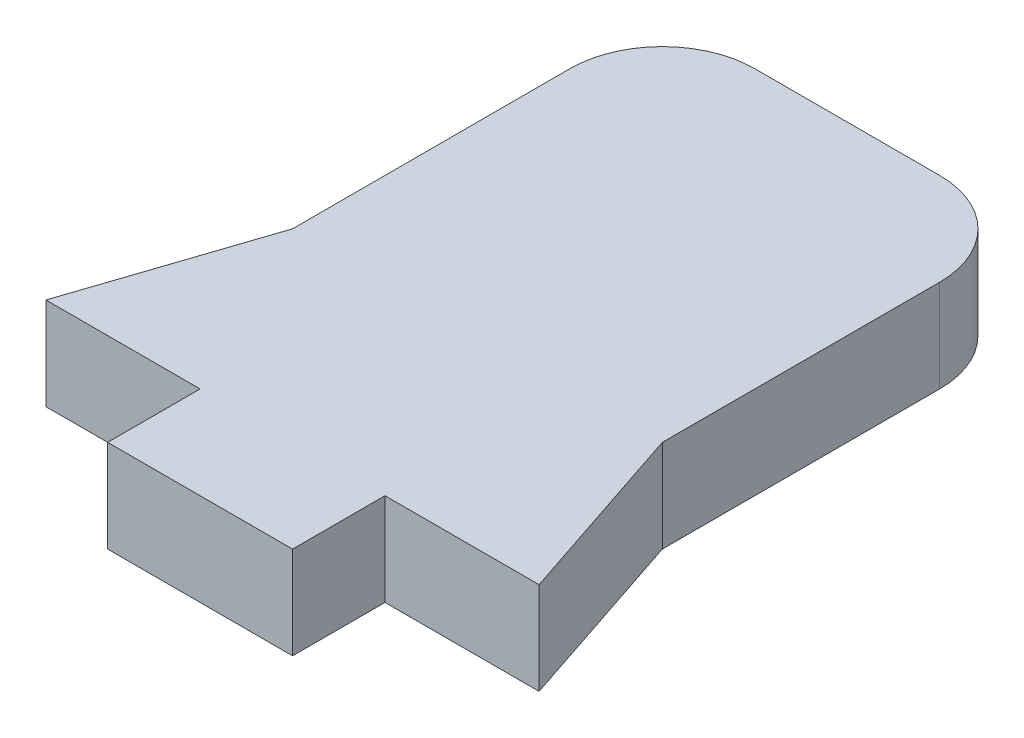
ISO-10303-21;
HEADER;
FILE_DESCRIPTION(('STEP AP214'),'2;1');
FILE_NAME('part.step','',(''),(''),'','','');
FILE_SCHEMA(('AUTOMOTIVE_DESIGN { 1 0 10303 214 1 1 1 1 }'));
ENDSEC;
DATA;
#1=APPLICATION_CONTEXT('core data for automotive mechanical design processes');
#2=APPLICATION_PROTOCOL_DEFINITION('international standard','automotive_design',2000,#1);
#3=PRODUCT_CONTEXT('',#1,'mechanical');
#4=PRODUCT('Part','Part','',(#3));
#5=PRODUCT_RELATED_PRODUCT_CATEGORY('part','',(#4));
#6=PRODUCT_DEFINITION_FORMATION('','',#4);
#7=PRODUCT_DEFINITION_CONTEXT('part definition',#1,'design');
#8=PRODUCT_DEFINITION('design','',#6,#7);
#9=PRODUCT_DEFINITION_SHAPE('','',#8);
#10=(LENGTH_UNIT() NAMED_UNIT(*) SI_UNIT(.MILLI.,.METRE.));
#11=(NAMED_UNIT(*) PLANE_ANGLE_UNIT() SI_UNIT($,.RADIAN.));
#12=(NAMED_UNIT(*) SI_UNIT($,.STERADIAN.) SOLID_ANGLE_UNIT());
#13=UNCERTAINTY_MEASURE_WITH_UNIT(LENGTH_MEASURE(1.E-05),#10,'distance_accuracy_value','');
#14=(GEOMETRIC_REPRESENTATION_CONTEXT(3) GLOBAL_UNCERTAINTY_ASSIGNED_CONTEXT((#13)) GLOBAL_UNIT_ASSIGNED_CONTEXT((#10,
#11,#12)) REPRESENTATION_CONTEXT('',''));
#15=CARTESIAN_POINT('',(0.,0.,0.));
#16=DIRECTION('',(0.,0.,1.));
#17=DIRECTION('',(1.,0.,0.));
#18=AXIS2_PLACEMENT_3D('',#15,#16,#17);
#19=CARTESIAN_POINT('',(6.,1.5,-7.5));
#20=DIRECTION('',(-1.,0.,0.));
#21=DIRECTION('',(0.,0.,1.));
#22=AXIS2_PLACEMENT_3D('',#19,#20,#21);
#23=PLANE('',#22);
#24=DIRECTION('',(0.,-1.,0.));
#25=VECTOR('',#24,1.);
#26=CARTESIAN_POINT('',(6.,1.5,1.5));
#27=LINE('',#26,#25);
#28=CARTESIAN_POINT('',(6.,1.5,1.5));
#29=VERTEX_POINT('',#28);
#30=CARTESIAN_POINT('',(6.,-1.5,1.5));
#31=VERTEX_POINT('',#30);
#32=EDGE_CURVE('E147',#29,#31,#27,.T.);
#33=ORIENTED_EDGE('',*,*,#32,.T.);
#34=DIRECTION('',(0.,0.,-1.));
#35=VECTOR('',#34,1.);
#36=CARTESIAN_POINT('',(6.,-1.5,-7.5));
#37=LINE('',#36,#35);
#38=CARTESIAN_POINT('',(6.,-1.5,-7.5));
#39=VERTEX_POINT('',#38);
#40=EDGE_CURVE('E188',#31,#39,#37,.T.);
#41=ORIENTED_EDGE('',*,*,#40,.T.);
#42=DIRECTION('',(0.,-1.,0.));
#43=VECTOR('',#42,1.);
#44=CARTESIAN_POINT('',(6.,1.5,-7.5));
#45=LINE('',#44,#43);
#46=CARTESIAN_POINT('',(6.,1.5,-7.5));
#47=VERTEX_POINT('',#46);
#48=EDGE_CURVE('E11',#47,#39,#45,.T.);
#49=ORIENTED_EDGE('',*,*,#48,.F.);
#50=DIRECTION('',(0.,0.,-1.));
#51=VECTOR('',#50,1.);
#52=CARTESIAN_POINT('',(6.,1.5,-7.5));
#53=LINE('',#52,#51);
#54=EDGE_CURVE('E50',#29,#47,#53,.T.);
#55=ORIENTED_EDGE('',*,*,#54,.F.);
#56=EDGE_LOOP('',(#33,#41,#49,#55));
#57=FACE_BOUND('',#56,.T.);
#58=ADVANCED_FACE('F36',(#57),#23,.F.);
#59=CARTESIAN_POINT('',(-6.,1.5,-7.5));
#60=DIRECTION('',(1.,0.,0.));
#61=DIRECTION('',(0.,0.,-1.));
#62=AXIS2_PLACEMENT_3D('',#59,#60,#61);
#63=PLANE('',#62);
#64=DIRECTION('',(0.,-1.,0.));
#65=VECTOR('',#64,1.);
#66=CARTESIAN_POINT('',(-6.,1.5,1.5));
#67=LINE('',#66,#65);
#68=CARTESIAN_POINT('',(-6.,1.5,1.5));
#69=VERTEX_POINT('',#68);
#70=CARTESIAN_POINT('',(-6.,-1.5,1.5));
#71=VERTEX_POINT('',#70);
#72=EDGE_CURVE('E58',#69,#71,#67,.T.);
#73=ORIENTED_EDGE('',*,*,#72,.F.);
#74=DIRECTION('',(0.,0.,1.));
#75=VECTOR('',#74,1.);
#76=CARTESIAN_POINT('',(-6.,1.5,-7.5));
#77=LINE('',#76,#75);
#78=CARTESIAN_POINT('',(-6.,1.5,-7.5));
#79=VERTEX_POINT('',#78);
#80=EDGE_CURVE('E137',#79,#69,#77,.T.);
#81=ORIENTED_EDGE('',*,*,#80,.F.);
#82=DIRECTION('',(0.,-1.,0.));
#83=VECTOR('',#82,1.);
#84=CARTESIAN_POINT('',(-6.,1.5,-7.5));
#85=LINE('',#84,#83);
#86=CARTESIAN_POINT('',(-6.,-1.5,-7.5));
#87=VERTEX_POINT('',#86);
#88=EDGE_CURVE('E199',#79,#87,#85,.T.);
#89=ORIENTED_EDGE('',*,*,#88,.T.);
#90=DIRECTION('',(0.,0.,1.));
#91=VECTOR('',#90,1.);
#92=CARTESIAN_POINT('',(-6.,-1.5,-7.5));
#93=LINE('',#92,#91);
#94=EDGE_CURVE('E207',#87,#71,#93,.T.);
#95=ORIENTED_EDGE('',*,*,#94,.T.);
#96=EDGE_LOOP('',(#73,#81,#89,#95));
#97=FACE_BOUND('',#96,.T.);
#98=ADVANCED_FACE('F234',(#97),#63,.F.);
#99=CARTESIAN_POINT('',(-6.,1.5,7.5));
#100=DIRECTION('',(0.,0.,-1.));
#101=DIRECTION('',(-1.,0.,0.));
#102=AXIS2_PLACEMENT_3D('',#99,#100,#101);
#103=PLANE('',#102);
#104=DIRECTION('',(0.,-1.,0.));
#105=VECTOR('',#104,1.);
#106=CARTESIAN_POINT('',(-3.00000000000001,1.5,7.5));
#107=LINE('',#106,#105);
#108=CARTESIAN_POINT('',(-3.00000000000001,1.5,7.5));
#109=VERTEX_POINT('',#108);
#110=CARTESIAN_POINT('',(-3.00000000000001,-1.5,7.5));
#111=VERTEX_POINT('',#110);
#112=EDGE_CURVE('E173',#109,#111,#107,.T.);
#113=ORIENTED_EDGE('',*,*,#112,.F.);
#114=DIRECTION('',(1.,0.,0.));
#115=VECTOR('',#114,1.);
#116=CARTESIAN_POINT('',(-6.,1.5,7.5));
#117=LINE('',#116,#115);
#118=CARTESIAN_POINT('',(-8.,1.5,7.5));
#119=VERTEX_POINT('',#118);
#120=EDGE_CURVE('E136',#119,#109,#117,.T.);
#121=ORIENTED_EDGE('',*,*,#120,.F.);
#122=DIRECTION('',(0.,-1.,0.));
#123=VECTOR('',#122,1.);
#124=CARTESIAN_POINT('',(-8.,1.5,7.5));
#125=LINE('',#124,#123);
#126=CARTESIAN_POINT('',(-8.,-1.5,7.5));
#127=VERTEX_POINT('',#126);
#128=EDGE_CURVE('E159',#119,#127,#125,.T.);
#129=ORIENTED_EDGE('',*,*,#128,.T.);
#130=DIRECTION('',(1.,0.,0.));
#131=VECTOR('',#130,1.);
#132=CARTESIAN_POINT('',(-6.,-1.5,7.5));
#133=LINE('',#132,#131);
#134=EDGE_CURVE('E191',#127,#111,#133,.T.);
#135=ORIENTED_EDGE('',*,*,#134,.T.);
#136=EDGE_LOOP('',(#113,#121,#129,#135));
#137=FACE_BOUND('',#136,.T.);
#138=ADVANCED_FACE('F241',(#137),#103,.F.);
#139=CARTESIAN_POINT('',(3.,1.5,-7.5));
#140=DIRECTION('',(0.,-1.,0.));
#141=DIRECTION('',(0.,0.,-1.));
#142=AXIS2_PLACEMENT_3D('',#139,#140,#141);
#143=CYLINDRICAL_SURFACE('',#142,3.);
#144=CARTESIAN_POINT('',(3.,-1.5,-7.5));
#145=DIRECTION('',(0.,1.,0.));
#146=DIRECTION('',(0.,0.,-1.));
#147=AXIS2_PLACEMENT_3D('',#144,#145,#146);
#148=CIRCLE('',#147,3.);
#149=CARTESIAN_POINT('',(3.,-1.5,-10.5));
#150=VERTEX_POINT('',#149);
#151=EDGE_CURVE('E201',#39,#150,#148,.T.);
#152=ORIENTED_EDGE('',*,*,#151,.T.);
#153=DIRECTION('',(0.,-1.,0.));
#154=VECTOR('',#153,1.);
#155=CARTESIAN_POINT('',(3.,1.5,-10.5));
#156=LINE('',#155,#154);
#157=CARTESIAN_POINT('',(3.,1.5,-10.5));
#158=VERTEX_POINT('',#157);
#159=EDGE_CURVE('E43',#158,#150,#156,.T.);
#160=ORIENTED_EDGE('',*,*,#159,.F.);
#161=CARTESIAN_POINT('',(3.,1.5,-7.5));
#162=DIRECTION('',(0.,1.,0.));
#163=DIRECTION('',(0.,0.,-1.));
#164=AXIS2_PLACEMENT_3D('',#161,#162,#163);
#165=CIRCLE('',#164,3.);
#166=EDGE_CURVE('E190',#47,#158,#165,.T.);
#167=ORIENTED_EDGE('',*,*,#166,.F.);
#168=ORIENTED_EDGE('',*,*,#48,.T.);
#169=EDGE_LOOP('',(#152,#160,#167,#168));
#170=FACE_BOUND('',#169,.T.);
#171=ADVANCED_FACE('F260',(#170),#143,.T.);
#172=CARTESIAN_POINT('',(-3.,1.5,-10.5));
#173=DIRECTION('',(0.,0.,1.));
#174=DIRECTION('',(1.,0.,0.));
#175=AXIS2_PLACEMENT_3D('',#172,#173,#174);
#176=PLANE('',#175);
#177=DIRECTION('',(-1.,0.,0.));
#178=VECTOR('',#177,1.);
#179=CARTESIAN_POINT('',(-3.,-1.5,-10.5));
#180=LINE('',#179,#178);
#181=CARTESIAN_POINT('',(-3.,-1.5,-10.5));
#182=VERTEX_POINT('',#181);
#183=EDGE_CURVE('E203',#150,#182,#180,.T.);
#184=ORIENTED_EDGE('',*,*,#183,.T.);
#185=DIRECTION('',(0.,-1.,0.));
#186=VECTOR('',#185,1.);
#187=CARTESIAN_POINT('',(-3.,1.5,-10.5));
#188=LINE('',#187,#186);
#189=CARTESIAN_POINT('',(-3.,1.5,-10.5));
#190=VERTEX_POINT('',#189);
#191=EDGE_CURVE('E213',#190,#182,#188,.T.);
#192=ORIENTED_EDGE('',*,*,#191,.F.);
#193=DIRECTION('',(-1.,0.,0.));
#194=VECTOR('',#193,1.);
#195=CARTESIAN_POINT('',(-3.,1.5,-10.5));
#196=LINE('',#195,#194);
#197=EDGE_CURVE('E193',#158,#190,#196,.T.);
#198=ORIENTED_EDGE('',*,*,#197,.F.);
#199=ORIENTED_EDGE('',*,*,#159,.T.);
#200=EDGE_LOOP('',(#184,#192,#198,#199));
#201=FACE_BOUND('',#200,.T.);
#202=ADVANCED_FACE('F220',(#201),#176,.F.);
#203=CARTESIAN_POINT('',(-3.,1.5,-7.5));
#204=DIRECTION('',(0.,-1.,0.));
#205=DIRECTION('',(0.,0.,-1.));
#206=AXIS2_PLACEMENT_3D('',#203,#204,#205);
#207=CYLINDRICAL_SURFACE('',#206,3.);
#208=CARTESIAN_POINT('',(-3.,-1.5,-7.5));
#209=DIRECTION('',(0.,1.,0.));
#210=DIRECTION('',(0.,0.,1.));
#211=AXIS2_PLACEMENT_3D('',#208,#209,#210);
#212=CIRCLE('',#211,3.);
#213=EDGE_CURVE('E205',#182,#87,#212,.T.);
#214=ORIENTED_EDGE('',*,*,#213,.T.);
#215=ORIENTED_EDGE('',*,*,#88,.F.);
#216=CARTESIAN_POINT('',(-3.,1.5,-7.5));
#217=DIRECTION('',(0.,1.,0.));
#218=DIRECTION('',(0.,0.,1.));
#219=AXIS2_PLACEMENT_3D('',#216,#217,#218);
#220=CIRCLE('',#219,3.);
#221=EDGE_CURVE('E195',#190,#79,#220,.T.);
#222=ORIENTED_EDGE('',*,*,#221,.F.);
#223=ORIENTED_EDGE('',*,*,#191,.T.);
#224=EDGE_LOOP('',(#214,#215,#222,#223));
#225=FACE_BOUND('',#224,.T.);
#226=ADVANCED_FACE('F232',(#225),#207,.T.);
#227=CARTESIAN_POINT('',(3.00000000000001,1.5,7.5));
#228=VERTEX_POINT('',#227);
#229=CARTESIAN_POINT('',(8.,1.5,7.5));
#230=VERTEX_POINT('',#229);
#231=EDGE_CURVE('E125',#228,#230,#117,.T.);
#232=ORIENTED_EDGE('',*,*,#231,.F.);
#233=DIRECTION('',(0.,-1.,0.));
#234=VECTOR('',#233,1.);
#235=CARTESIAN_POINT('',(3.00000000000001,1.5,7.5));
#236=LINE('',#235,#234);
#237=CARTESIAN_POINT('',(3.00000000000001,-1.5,7.5));
#238=VERTEX_POINT('',#237);
#239=EDGE_CURVE('E180',#228,#238,#236,.T.);
#240=ORIENTED_EDGE('',*,*,#239,.T.);
#241=CARTESIAN_POINT('',(8.,-1.5,7.5));
#242=VERTEX_POINT('',#241);
#243=EDGE_CURVE('E143',#238,#242,#133,.T.);
#244=ORIENTED_EDGE('',*,*,#243,.T.);
#245=DIRECTION('',(0.,-1.,0.));
#246=VECTOR('',#245,1.);
#247=CARTESIAN_POINT('',(8.,1.5,7.5));
#248=LINE('',#247,#246);
#249=EDGE_CURVE('E140',#230,#242,#248,.T.);
#250=ORIENTED_EDGE('',*,*,#249,.F.);
#251=EDGE_LOOP('',(#232,#240,#244,#250));
#252=FACE_BOUND('',#251,.T.);
#253=ADVANCED_FACE('F141',(#252),#103,.F.);
#254=CARTESIAN_POINT('',(-3.,1.5,-7.5));
#255=DIRECTION('',(0.,1.,0.));
#256=DIRECTION('',(0.,0.,1.));
#257=AXIS2_PLACEMENT_3D('',#254,#255,#256);
#258=PLANE('',#257);
#259=ORIENTED_EDGE('',*,*,#231,.T.);
#260=DIRECTION('',(-0.316227766016838,0.,-0.948683298050514));
#261=VECTOR('',#260,1.);
#262=CARTESIAN_POINT('',(6.,1.5,1.5));
#263=LINE('',#262,#261);
#264=EDGE_CURVE('E129',#230,#29,#263,.T.);
#265=ORIENTED_EDGE('',*,*,#264,.T.);
#266=ORIENTED_EDGE('',*,*,#54,.T.);
#267=ORIENTED_EDGE('',*,*,#166,.T.);
#268=ORIENTED_EDGE('',*,*,#197,.T.);
#269=ORIENTED_EDGE('',*,*,#221,.T.);
#270=ORIENTED_EDGE('',*,*,#80,.T.);
#271=DIRECTION('',(-0.316227766016838,0.,0.948683298050514));
#272=VECTOR('',#271,1.);
#273=CARTESIAN_POINT('',(-6.,1.5,1.5));
#274=LINE('',#273,#272);
#275=EDGE_CURVE('E156',#69,#119,#274,.T.);
#276=ORIENTED_EDGE('',*,*,#275,.T.);
#277=ORIENTED_EDGE('',*,*,#120,.T.);
#278=DIRECTION('',(0.,0.,1.));
#279=VECTOR('',#278,1.);
#280=CARTESIAN_POINT('',(-3.00000000000001,1.5,7.5));
#281=LINE('',#280,#279);
#282=CARTESIAN_POINT('',(-3.00000000000001,1.5,10.5));
#283=VERTEX_POINT('',#282);
#284=EDGE_CURVE('E166',#109,#283,#281,.T.);
#285=ORIENTED_EDGE('',*,*,#284,.T.);
#286=DIRECTION('',(1.,0.,0.));
#287=VECTOR('',#286,1.);
#288=CARTESIAN_POINT('',(-3.00000000000001,1.5,10.5));
#289=LINE('',#288,#287);
#290=CARTESIAN_POINT('',(2.99999999999999,1.5,10.5));
#291=VERTEX_POINT('',#290);
#292=EDGE_CURVE('E169',#283,#291,#289,.T.);
#293=ORIENTED_EDGE('',*,*,#292,.T.);
#294=DIRECTION('',(0.,0.,-1.));
#295=VECTOR('',#294,1.);
#296=CARTESIAN_POINT('',(3.00000000000001,1.5,7.5));
#297=LINE('',#296,#295);
#298=EDGE_CURVE('E132',#291,#228,#297,.T.);
#299=ORIENTED_EDGE('',*,*,#298,.T.);
#300=EDGE_LOOP('',(#259,#265,#266,#267,#268,#269,#270,#276,#277,#285,#293,#299));
#301=FACE_BOUND('',#300,.T.);
#302=ADVANCED_FACE('F127',(#301),#258,.T.);
#303=CARTESIAN_POINT('',(-3.,-1.5,-7.5));
#304=DIRECTION('',(0.,1.,0.));
#305=DIRECTION('',(0.,0.,1.));
#306=AXIS2_PLACEMENT_3D('',#303,#304,#305);
#307=PLANE('',#306);
#308=ORIENTED_EDGE('',*,*,#40,.F.);
#309=DIRECTION('',(-0.316227766016838,0.,-0.948683298050514));
#310=VECTOR('',#309,1.);
#311=CARTESIAN_POINT('',(6.,-1.5,1.5));
#312=LINE('',#311,#310);
#313=EDGE_CURVE('E150',#242,#31,#312,.T.);
#314=ORIENTED_EDGE('',*,*,#313,.F.);
#315=ORIENTED_EDGE('',*,*,#243,.F.);
#316=DIRECTION('',(0.,0.,-1.));
#317=VECTOR('',#316,1.);
#318=CARTESIAN_POINT('',(3.00000000000001,-1.5,7.5));
#319=LINE('',#318,#317);
#320=CARTESIAN_POINT('',(2.99999999999999,-1.5,10.5));
#321=VERTEX_POINT('',#320);
#322=EDGE_CURVE('E170',#321,#238,#319,.T.);
#323=ORIENTED_EDGE('',*,*,#322,.F.);
#324=DIRECTION('',(1.,0.,0.));
#325=VECTOR('',#324,1.);
#326=CARTESIAN_POINT('',(-3.00000000000001,-1.5,10.5));
#327=LINE('',#326,#325);
#328=CARTESIAN_POINT('',(-3.00000000000001,-1.5,10.5));
#329=VERTEX_POINT('',#328);
#330=EDGE_CURVE('E176',#329,#321,#327,.T.);
#331=ORIENTED_EDGE('',*,*,#330,.F.);
#332=DIRECTION('',(0.,0.,1.));
#333=VECTOR('',#332,1.);
#334=CARTESIAN_POINT('',(-3.00000000000001,-1.5,7.5));
#335=LINE('',#334,#333);
#336=EDGE_CURVE('E165',#111,#329,#335,.T.);
#337=ORIENTED_EDGE('',*,*,#336,.F.);
#338=ORIENTED_EDGE('',*,*,#134,.F.);
#339=DIRECTION('',(-0.316227766016838,0.,0.948683298050514));
#340=VECTOR('',#339,1.);
#341=CARTESIAN_POINT('',(-6.,-1.5,1.5));
#342=LINE('',#341,#340);
#343=EDGE_CURVE('E155',#71,#127,#342,.T.);
#344=ORIENTED_EDGE('',*,*,#343,.F.);
#345=ORIENTED_EDGE('',*,*,#94,.F.);
#346=ORIENTED_EDGE('',*,*,#213,.F.);
#347=ORIENTED_EDGE('',*,*,#183,.F.);
#348=ORIENTED_EDGE('',*,*,#151,.F.);
#349=EDGE_LOOP('',(#308,#314,#315,#323,#331,#337,#338,#344,#345,#346,#347,#348));
#350=FACE_BOUND('',#349,.T.);
#351=ADVANCED_FACE('F227',(#350),#307,.F.);
#352=CARTESIAN_POINT('',(-3.00000000000001,1.5,7.5));
#353=DIRECTION('',(1.,0.,0.));
#354=DIRECTION('',(0.,0.,-1.));
#355=AXIS2_PLACEMENT_3D('',#352,#353,#354);
#356=PLANE('',#355);
#357=ORIENTED_EDGE('',*,*,#336,.T.);
#358=DIRECTION('',(0.,-1.,0.));
#359=VECTOR('',#358,1.);
#360=CARTESIAN_POINT('',(-3.00000000000001,1.5,10.5));
#361=LINE('',#360,#359);
#362=EDGE_CURVE('E185',#283,#329,#361,.T.);
#363=ORIENTED_EDGE('',*,*,#362,.F.);
#364=ORIENTED_EDGE('',*,*,#284,.F.);
#365=ORIENTED_EDGE('',*,*,#112,.T.);
#366=EDGE_LOOP('',(#357,#363,#364,#365));
#367=FACE_BOUND('',#366,.T.);
#368=ADVANCED_FACE('F245',(#367),#356,.F.);
#369=CARTESIAN_POINT('',(-3.00000000000001,1.5,10.5));
#370=DIRECTION('',(0.,0.,-1.));
#371=DIRECTION('',(-1.,0.,0.));
#372=AXIS2_PLACEMENT_3D('',#369,#370,#371);
#373=PLANE('',#372);
#374=ORIENTED_EDGE('',*,*,#330,.T.);
#375=DIRECTION('',(0.,-1.,0.));
#376=VECTOR('',#375,1.);
#377=CARTESIAN_POINT('',(2.99999999999999,1.5,10.5));
#378=LINE('',#377,#376);
#379=EDGE_CURVE('E182',#291,#321,#378,.T.);
#380=ORIENTED_EDGE('',*,*,#379,.F.);
#381=ORIENTED_EDGE('',*,*,#292,.F.);
#382=ORIENTED_EDGE('',*,*,#362,.T.);
#383=EDGE_LOOP('',(#374,#380,#381,#382));
#384=FACE_BOUND('',#383,.T.);
#385=ADVANCED_FACE('F248',(#384),#373,.F.);
#386=CARTESIAN_POINT('',(3.00000000000001,1.5,7.5));
#387=DIRECTION('',(-1.,0.,0.));
#388=DIRECTION('',(0.,0.,1.));
#389=AXIS2_PLACEMENT_3D('',#386,#387,#388);
#390=PLANE('',#389);
#391=ORIENTED_EDGE('',*,*,#322,.T.);
#392=ORIENTED_EDGE('',*,*,#239,.F.);
#393=ORIENTED_EDGE('',*,*,#298,.F.);
#394=ORIENTED_EDGE('',*,*,#379,.T.);
#395=EDGE_LOOP('',(#391,#392,#393,#394));
#396=FACE_BOUND('',#395,.T.);
#397=ADVANCED_FACE('F251',(#396),#390,.F.);
#398=CARTESIAN_POINT('',(-6.,1.5,1.5));
#399=DIRECTION('',(0.948683298050514,0.,0.316227766016838));
#400=DIRECTION('',(0.316227766016838,0.,-0.948683298050514));
#401=AXIS2_PLACEMENT_3D('',#398,#399,#400);
#402=PLANE('',#401);
#403=ORIENTED_EDGE('',*,*,#343,.T.);
#404=ORIENTED_EDGE('',*,*,#128,.F.);
#405=ORIENTED_EDGE('',*,*,#275,.F.);
#406=ORIENTED_EDGE('',*,*,#72,.T.);
#407=EDGE_LOOP('',(#403,#404,#405,#406));
#408=FACE_BOUND('',#407,.T.);
#409=ADVANCED_FACE('F238',(#408),#402,.F.);
#410=CARTESIAN_POINT('',(6.,1.5,1.5));
#411=DIRECTION('',(-0.948683298050514,0.,0.316227766016838));
#412=DIRECTION('',(0.316227766016838,0.,0.948683298050514));
#413=AXIS2_PLACEMENT_3D('',#410,#411,#412);
#414=PLANE('',#413);
#415=ORIENTED_EDGE('',*,*,#313,.T.);
#416=ORIENTED_EDGE('',*,*,#32,.F.);
#417=ORIENTED_EDGE('',*,*,#264,.F.);
#418=ORIENTED_EDGE('',*,*,#249,.T.);
#419=EDGE_LOOP('',(#415,#416,#417,#418));
#420=FACE_BOUND('',#419,.T.);
#421=ADVANCED_FACE('F149',(#420),#414,.F.);
#422=CLOSED_SHELL('',(#58,#98,#138,#171,#202,#226,#253,#302,#351,#368,#385,#397,#409,#421));
#423=MANIFOLD_SOLID_BREP('B2',#422);
#424=ADVANCED_BREP_SHAPE_REPRESENTATION('',(#18,#423),#14);
#425=SHAPE_DEFINITION_REPRESENTATION(#9,#424);
ENDSEC;
END-ISO-10303-21;
